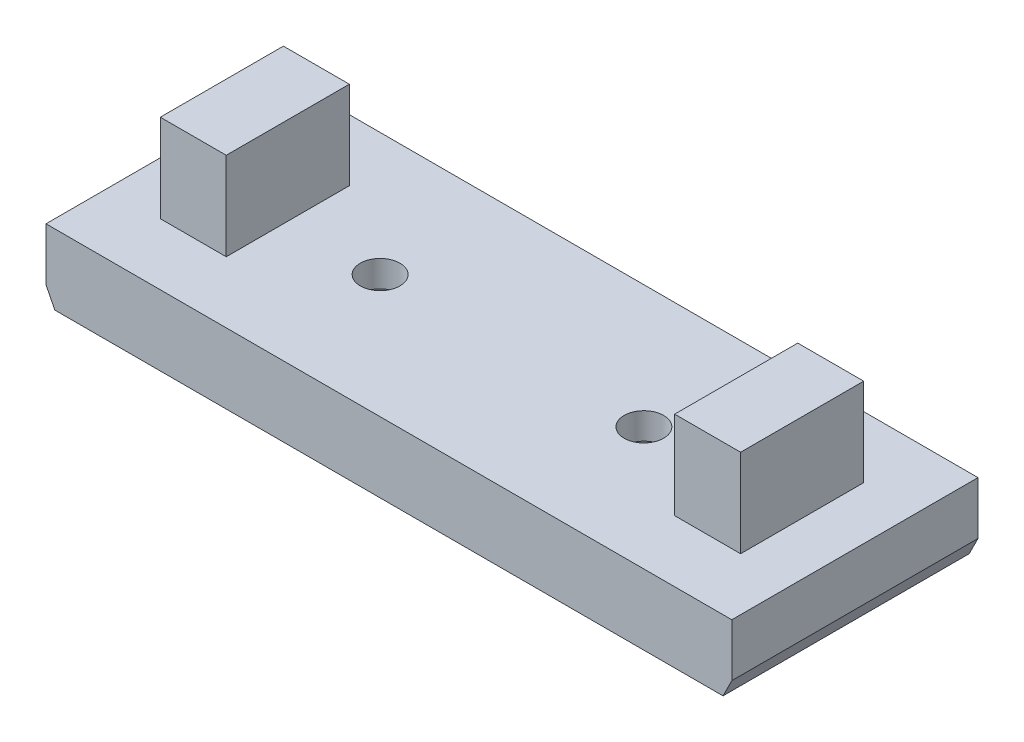
ISO-10303-21;
HEADER;
FILE_DESCRIPTION(('STEP AP214'),'2;1');
FILE_NAME('part.step','',(''),(''),'','','');
FILE_SCHEMA(('AUTOMOTIVE_DESIGN { 1 0 10303 214 1 1 1 1 }'));
ENDSEC;
DATA;
#1=APPLICATION_CONTEXT('core data for automotive mechanical design processes');
#2=APPLICATION_PROTOCOL_DEFINITION('international standard','automotive_design',2000,#1);
#3=PRODUCT_CONTEXT('',#1,'mechanical');
#4=PRODUCT('Part','Part','',(#3));
#5=PRODUCT_RELATED_PRODUCT_CATEGORY('part','',(#4));
#6=PRODUCT_DEFINITION_FORMATION('','',#4);
#7=PRODUCT_DEFINITION_CONTEXT('part definition',#1,'design');
#8=PRODUCT_DEFINITION('design','',#6,#7);
#9=PRODUCT_DEFINITION_SHAPE('','',#8);
#10=(LENGTH_UNIT() NAMED_UNIT(*) SI_UNIT(.MILLI.,.METRE.));
#11=(NAMED_UNIT(*) PLANE_ANGLE_UNIT() SI_UNIT($,.RADIAN.));
#12=(NAMED_UNIT(*) SI_UNIT($,.STERADIAN.) SOLID_ANGLE_UNIT());
#13=UNCERTAINTY_MEASURE_WITH_UNIT(LENGTH_MEASURE(1.E-05),#10,'distance_accuracy_value','');
#14=(GEOMETRIC_REPRESENTATION_CONTEXT(3) GLOBAL_UNCERTAINTY_ASSIGNED_CONTEXT((#13)) GLOBAL_UNIT_ASSIGNED_CONTEXT((#10,
#11,#12)) REPRESENTATION_CONTEXT('',''));
#15=CARTESIAN_POINT('',(0.,0.,0.));
#16=DIRECTION('',(0.,0.,1.));
#17=DIRECTION('',(1.,0.,0.));
#18=AXIS2_PLACEMENT_3D('',#15,#16,#17);
#19=CARTESIAN_POINT('',(0.,4.,0.));
#20=DIRECTION('',(0.,1.,0.));
#21=DIRECTION('',(0.,0.,1.));
#22=AXIS2_PLACEMENT_3D('',#19,#20,#21);
#23=PLANE('',#22);
#24=CARTESIAN_POINT('',(7.50000000000003,4.,0.));
#25=DIRECTION('',(0.,1.,0.));
#26=DIRECTION('',(0.,0.,1.));
#27=AXIS2_PLACEMENT_3D('',#24,#25,#26);
#28=CIRCLE('',#27,1.125);
#29=CARTESIAN_POINT('',(7.50000000000003,4.,1.125));
#30=VERTEX_POINT('',#29);
#31=EDGE_CURVE('E249',#30,#30,#28,.F.);
#32=ORIENTED_EDGE('',*,*,#31,.T.);
#33=EDGE_LOOP('',(#32));
#34=FACE_BOUND('',#33,.T.);
#35=CARTESIAN_POINT('',(-7.5,4.,0.));
#36=DIRECTION('',(0.,1.,0.));
#37=DIRECTION('',(0.,0.,1.));
#38=AXIS2_PLACEMENT_3D('',#35,#36,#37);
#39=CIRCLE('',#38,1.125);
#40=CARTESIAN_POINT('',(-7.5,4.,1.125));
#41=VERTEX_POINT('',#40);
#42=EDGE_CURVE('E238',#41,#41,#39,.F.);
#43=ORIENTED_EDGE('',*,*,#42,.T.);
#44=EDGE_LOOP('',(#43));
#45=FACE_BOUND('',#44,.T.);
#46=DIRECTION('',(0.,0.,1.));
#47=VECTOR('',#46,1.);
#48=CARTESIAN_POINT('',(-19.5,4.,-7.));
#49=LINE('',#48,#47);
#50=CARTESIAN_POINT('',(-19.5,4.,-7.));
#51=VERTEX_POINT('',#50);
#52=CARTESIAN_POINT('',(-19.5,4.,7.));
#53=VERTEX_POINT('',#52);
#54=EDGE_CURVE('E345',#51,#53,#49,.T.);
#55=ORIENTED_EDGE('',*,*,#54,.T.);
#56=DIRECTION('',(1.,0.,0.));
#57=VECTOR('',#56,1.);
#58=CARTESIAN_POINT('',(-19.5,4.,7.));
#59=LINE('',#58,#57);
#60=CARTESIAN_POINT('',(19.5,4.,7.));
#61=VERTEX_POINT('',#60);
#62=EDGE_CURVE('E348',#53,#61,#59,.T.);
#63=ORIENTED_EDGE('',*,*,#62,.T.);
#64=DIRECTION('',(0.,0.,-1.));
#65=VECTOR('',#64,1.);
#66=CARTESIAN_POINT('',(19.5,4.,-7.));
#67=LINE('',#66,#65);
#68=CARTESIAN_POINT('',(19.5,4.,-7.));
#69=VERTEX_POINT('',#68);
#70=EDGE_CURVE('E229',#61,#69,#67,.T.);
#71=ORIENTED_EDGE('',*,*,#70,.T.);
#72=DIRECTION('',(-1.,0.,0.));
#73=VECTOR('',#72,1.);
#74=CARTESIAN_POINT('',(-19.5,4.,-7.));
#75=LINE('',#74,#73);
#76=EDGE_CURVE('E351',#69,#51,#75,.T.);
#77=ORIENTED_EDGE('',*,*,#76,.T.);
#78=EDGE_LOOP('',(#55,#63,#71,#77));
#79=FACE_BOUND('',#78,.T.);
#80=DIRECTION('',(-1.,0.,0.));
#81=VECTOR('',#80,1.);
#82=CARTESIAN_POINT('',(-12.75,4.,-3.5));
#83=LINE('',#82,#81);
#84=CARTESIAN_POINT('',(-12.75,4.,-3.5));
#85=VERTEX_POINT('',#84);
#86=CARTESIAN_POINT('',(-16.5,4.,-3.5));
#87=VERTEX_POINT('',#86);
#88=EDGE_CURVE('E417',#85,#87,#83,.T.);
#89=ORIENTED_EDGE('',*,*,#88,.F.);
#90=DIRECTION('',(0.,0.,-1.));
#91=VECTOR('',#90,1.);
#92=CARTESIAN_POINT('',(-12.75,4.,-3.5));
#93=LINE('',#92,#91);
#94=CARTESIAN_POINT('',(-12.75,4.,3.5));
#95=VERTEX_POINT('',#94);
#96=EDGE_CURVE('E403',#95,#85,#93,.T.);
#97=ORIENTED_EDGE('',*,*,#96,.F.);
#98=DIRECTION('',(1.,0.,0.));
#99=VECTOR('',#98,1.);
#100=CARTESIAN_POINT('',(-12.75,4.,3.5));
#101=LINE('',#100,#99);
#102=CARTESIAN_POINT('',(-16.5,4.,3.5));
#103=VERTEX_POINT('',#102);
#104=EDGE_CURVE('E408',#103,#95,#101,.T.);
#105=ORIENTED_EDGE('',*,*,#104,.F.);
#106=DIRECTION('',(0.,0.,1.));
#107=VECTOR('',#106,1.);
#108=CARTESIAN_POINT('',(-16.5,4.,-3.5));
#109=LINE('',#108,#107);
#110=EDGE_CURVE('E419',#87,#103,#109,.T.);
#111=ORIENTED_EDGE('',*,*,#110,.F.);
#112=EDGE_LOOP('',(#89,#97,#105,#111));
#113=FACE_BOUND('',#112,.T.);
#114=DIRECTION('',(1.,0.,0.));
#115=VECTOR('',#114,1.);
#116=CARTESIAN_POINT('',(12.75,4.,3.5));
#117=LINE('',#116,#115);
#118=CARTESIAN_POINT('',(12.75,4.,3.5));
#119=VERTEX_POINT('',#118);
#120=CARTESIAN_POINT('',(16.5,4.,3.5));
#121=VERTEX_POINT('',#120);
#122=EDGE_CURVE('E369',#119,#121,#117,.T.);
#123=ORIENTED_EDGE('',*,*,#122,.F.);
#124=DIRECTION('',(0.,0.,1.));
#125=VECTOR('',#124,1.);
#126=CARTESIAN_POINT('',(12.75,4.,-3.5));
#127=LINE('',#126,#125);
#128=CARTESIAN_POINT('',(12.75,4.,-3.5));
#129=VERTEX_POINT('',#128);
#130=EDGE_CURVE('E366',#129,#119,#127,.T.);
#131=ORIENTED_EDGE('',*,*,#130,.F.);
#132=DIRECTION('',(-1.,0.,0.));
#133=VECTOR('',#132,1.);
#134=CARTESIAN_POINT('',(12.75,4.,-3.5));
#135=LINE('',#134,#133);
#136=CARTESIAN_POINT('',(16.5,4.,-3.5));
#137=VERTEX_POINT('',#136);
#138=EDGE_CURVE('E382',#137,#129,#135,.T.);
#139=ORIENTED_EDGE('',*,*,#138,.F.);
#140=DIRECTION('',(0.,0.,-1.));
#141=VECTOR('',#140,1.);
#142=CARTESIAN_POINT('',(16.5,4.,-3.5));
#143=LINE('',#142,#141);
#144=EDGE_CURVE('E390',#121,#137,#143,.T.);
#145=ORIENTED_EDGE('',*,*,#144,.F.);
#146=EDGE_LOOP('',(#123,#131,#139,#145));
#147=FACE_BOUND('',#146,.T.);
#148=ADVANCED_FACE('F35',(#34,#45,#79,#113,#147),#23,.T.);
#149=CARTESIAN_POINT('',(-19.5,4.,-7.));
#150=DIRECTION('',(1.,0.,0.));
#151=DIRECTION('',(0.,0.,-1.));
#152=AXIS2_PLACEMENT_3D('',#149,#150,#151);
#153=PLANE('',#152);
#154=DIRECTION('',(0.,-1.,0.));
#155=VECTOR('',#154,1.);
#156=CARTESIAN_POINT('',(-19.5,4.,-7.));
#157=LINE('',#156,#155);
#158=CARTESIAN_POINT('',(-19.5,1.,-7.));
#159=VERTEX_POINT('',#158);
#160=EDGE_CURVE('E232',#51,#159,#157,.T.);
#161=ORIENTED_EDGE('',*,*,#160,.T.);
#162=DIRECTION('',(0.,0.,1.));
#163=VECTOR('',#162,1.);
#164=CARTESIAN_POINT('',(-19.5,1.,-8.1180339887499));
#165=LINE('',#164,#163);
#166=CARTESIAN_POINT('',(-19.5,1.,7.));
#167=VERTEX_POINT('',#166);
#168=EDGE_CURVE('E360',#159,#167,#165,.T.);
#169=ORIENTED_EDGE('',*,*,#168,.T.);
#170=DIRECTION('',(0.,-1.,0.));
#171=VECTOR('',#170,1.);
#172=CARTESIAN_POINT('',(-19.5,4.,7.));
#173=LINE('',#172,#171);
#174=EDGE_CURVE('E12',#53,#167,#173,.T.);
#175=ORIENTED_EDGE('',*,*,#174,.F.);
#176=ORIENTED_EDGE('',*,*,#54,.F.);
#177=EDGE_LOOP('',(#161,#169,#175,#176));
#178=FACE_BOUND('',#177,.T.);
#179=ADVANCED_FACE('F37',(#178),#153,.F.);
#180=CARTESIAN_POINT('',(-19.5,4.,7.));
#181=DIRECTION('',(0.,0.,-1.));
#182=DIRECTION('',(-1.,0.,0.));
#183=AXIS2_PLACEMENT_3D('',#180,#181,#182);
#184=PLANE('',#183);
#185=DIRECTION('',(1.,0.,0.));
#186=VECTOR('',#185,1.);
#187=CARTESIAN_POINT('',(-19.5,0.,7.));
#188=LINE('',#187,#186);
#189=CARTESIAN_POINT('',(-19.,0.,7.));
#190=VERTEX_POINT('',#189);
#191=CARTESIAN_POINT('',(19.,0.,7.));
#192=VERTEX_POINT('',#191);
#193=EDGE_CURVE('E226',#190,#192,#188,.T.);
#194=ORIENTED_EDGE('',*,*,#193,.T.);
#195=DIRECTION('',(-0.447213595499958,-0.894427190999916,0.));
#196=VECTOR('',#195,1.);
#197=CARTESIAN_POINT('',(19.,0.,7.));
#198=LINE('',#197,#196);
#199=CARTESIAN_POINT('',(19.5,1.,7.));
#200=VERTEX_POINT('',#199);
#201=EDGE_CURVE('E52',#200,#192,#198,.T.);
#202=ORIENTED_EDGE('',*,*,#201,.F.);
#203=DIRECTION('',(0.,-1.,0.));
#204=VECTOR('',#203,1.);
#205=CARTESIAN_POINT('',(19.5,4.,7.));
#206=LINE('',#205,#204);
#207=EDGE_CURVE('E44',#61,#200,#206,.T.);
#208=ORIENTED_EDGE('',*,*,#207,.F.);
#209=ORIENTED_EDGE('',*,*,#62,.F.);
#210=ORIENTED_EDGE('',*,*,#174,.T.);
#211=DIRECTION('',(-0.447213595499958,0.894427190999916,0.));
#212=VECTOR('',#211,1.);
#213=CARTESIAN_POINT('',(-19.5,1.,7.));
#214=LINE('',#213,#212);
#215=EDGE_CURVE('E375',#190,#167,#214,.T.);
#216=ORIENTED_EDGE('',*,*,#215,.F.);
#217=EDGE_LOOP('',(#194,#202,#208,#209,#210,#216));
#218=FACE_BOUND('',#217,.T.);
#219=ADVANCED_FACE('F222',(#218),#184,.F.);
#220=CARTESIAN_POINT('',(19.5,4.,-7.));
#221=DIRECTION('',(-1.,0.,0.));
#222=DIRECTION('',(0.,0.,1.));
#223=AXIS2_PLACEMENT_3D('',#220,#221,#222);
#224=PLANE('',#223);
#225=ORIENTED_EDGE('',*,*,#207,.T.);
#226=DIRECTION('',(0.,0.,1.));
#227=VECTOR('',#226,1.);
#228=CARTESIAN_POINT('',(19.5,1.,-8.1180339887499));
#229=LINE('',#228,#227);
#230=CARTESIAN_POINT('',(19.5,1.,-7.));
#231=VERTEX_POINT('',#230);
#232=EDGE_CURVE('E210',#231,#200,#229,.T.);
#233=ORIENTED_EDGE('',*,*,#232,.F.);
#234=DIRECTION('',(0.,-1.,0.));
#235=VECTOR('',#234,1.);
#236=CARTESIAN_POINT('',(19.5,4.,-7.));
#237=LINE('',#236,#235);
#238=EDGE_CURVE('E230',#69,#231,#237,.T.);
#239=ORIENTED_EDGE('',*,*,#238,.F.);
#240=ORIENTED_EDGE('',*,*,#70,.F.);
#241=EDGE_LOOP('',(#225,#233,#239,#240));
#242=FACE_BOUND('',#241,.T.);
#243=ADVANCED_FACE('F228',(#242),#224,.F.);
#244=CARTESIAN_POINT('',(-19.5,4.,-7.));
#245=DIRECTION('',(0.,0.,1.));
#246=DIRECTION('',(1.,0.,0.));
#247=AXIS2_PLACEMENT_3D('',#244,#245,#246);
#248=PLANE('',#247);
#249=ORIENTED_EDGE('',*,*,#238,.T.);
#250=DIRECTION('',(0.447213595499958,0.894427190999916,0.));
#251=VECTOR('',#250,1.);
#252=CARTESIAN_POINT('',(19.,0.,-7.));
#253=LINE('',#252,#251);
#254=CARTESIAN_POINT('',(19.,0.,-7.));
#255=VERTEX_POINT('',#254);
#256=EDGE_CURVE('E212',#255,#231,#253,.T.);
#257=ORIENTED_EDGE('',*,*,#256,.F.);
#258=DIRECTION('',(-1.,0.,0.));
#259=VECTOR('',#258,1.);
#260=CARTESIAN_POINT('',(-19.5,0.,-7.));
#261=LINE('',#260,#259);
#262=CARTESIAN_POINT('',(-19.,0.,-7.));
#263=VERTEX_POINT('',#262);
#264=EDGE_CURVE('E60',#255,#263,#261,.T.);
#265=ORIENTED_EDGE('',*,*,#264,.T.);
#266=DIRECTION('',(0.447213595499958,-0.894427190999916,0.));
#267=VECTOR('',#266,1.);
#268=CARTESIAN_POINT('',(-19.5,1.,-7.));
#269=LINE('',#268,#267);
#270=EDGE_CURVE('E363',#159,#263,#269,.T.);
#271=ORIENTED_EDGE('',*,*,#270,.F.);
#272=ORIENTED_EDGE('',*,*,#160,.F.);
#273=ORIENTED_EDGE('',*,*,#76,.F.);
#274=EDGE_LOOP('',(#249,#257,#265,#271,#272,#273));
#275=FACE_BOUND('',#274,.T.);
#276=ADVANCED_FACE('F362',(#275),#248,.F.);
#277=CARTESIAN_POINT('',(0.,0.,0.));
#278=DIRECTION('',(0.,1.,0.));
#279=DIRECTION('',(0.,0.,1.));
#280=AXIS2_PLACEMENT_3D('',#277,#278,#279);
#281=PLANE('',#280);
#282=DIRECTION('',(-1.,0.,0.));
#283=VECTOR('',#282,1.);
#284=CARTESIAN_POINT('',(-6.24426316451256,0.,2.175));
#285=LINE('',#284,#283);
#286=CARTESIAN_POINT('',(-6.24426316451256,0.,2.175));
#287=VERTEX_POINT('',#286);
#288=CARTESIAN_POINT('',(-8.75573683548744,0.,2.175));
#289=VERTEX_POINT('',#288);
#290=EDGE_CURVE('E262',#287,#289,#285,.T.);
#291=ORIENTED_EDGE('',*,*,#290,.F.);
#292=DIRECTION('',(-0.5,0.,0.866025403784439));
#293=VECTOR('',#292,1.);
#294=CARTESIAN_POINT('',(-4.98852632902513,0.,0.));
#295=LINE('',#294,#293);
#296=CARTESIAN_POINT('',(-4.98852632902513,0.,0.));
#297=VERTEX_POINT('',#296);
#298=EDGE_CURVE('E242',#297,#287,#295,.T.);
#299=ORIENTED_EDGE('',*,*,#298,.F.);
#300=DIRECTION('',(0.5,0.,0.866025403784439));
#301=VECTOR('',#300,1.);
#302=CARTESIAN_POINT('',(-6.24426316451256,0.,-2.175));
#303=LINE('',#302,#301);
#304=CARTESIAN_POINT('',(-6.24426316451256,0.,-2.175));
#305=VERTEX_POINT('',#304);
#306=EDGE_CURVE('E237',#305,#297,#303,.T.);
#307=ORIENTED_EDGE('',*,*,#306,.F.);
#308=DIRECTION('',(1.,0.,0.));
#309=VECTOR('',#308,1.);
#310=CARTESIAN_POINT('',(-8.75573683548743,0.,-2.175));
#311=LINE('',#310,#309);
#312=CARTESIAN_POINT('',(-8.75573683548743,0.,-2.175));
#313=VERTEX_POINT('',#312);
#314=EDGE_CURVE('E253',#313,#305,#311,.T.);
#315=ORIENTED_EDGE('',*,*,#314,.F.);
#316=DIRECTION('',(0.5,0.,-0.866025403784439));
#317=VECTOR('',#316,1.);
#318=CARTESIAN_POINT('',(-10.0114736709749,0.,0.));
#319=LINE('',#318,#317);
#320=CARTESIAN_POINT('',(-10.0114736709749,0.,0.));
#321=VERTEX_POINT('',#320);
#322=EDGE_CURVE('E256',#321,#313,#319,.T.);
#323=ORIENTED_EDGE('',*,*,#322,.F.);
#324=DIRECTION('',(-0.5,0.,-0.866025403784439));
#325=VECTOR('',#324,1.);
#326=CARTESIAN_POINT('',(-8.75573683548744,0.,2.175));
#327=LINE('',#326,#325);
#328=EDGE_CURVE('E259',#289,#321,#327,.T.);
#329=ORIENTED_EDGE('',*,*,#328,.F.);
#330=EDGE_LOOP('',(#291,#299,#307,#315,#323,#329));
#331=FACE_BOUND('',#330,.T.);
#332=DIRECTION('',(-1.,0.,0.));
#333=VECTOR('',#332,1.);
#334=CARTESIAN_POINT('',(8.75573683548741,0.,2.17500000000001));
#335=LINE('',#334,#333);
#336=CARTESIAN_POINT('',(8.75573683548741,0.,2.17500000000001));
#337=VERTEX_POINT('',#336);
#338=CARTESIAN_POINT('',(6.24426316451259,0.,2.17500000000001));
#339=VERTEX_POINT('',#338);
#340=EDGE_CURVE('E307',#337,#339,#335,.T.);
#341=ORIENTED_EDGE('',*,*,#340,.F.);
#342=DIRECTION('',(-0.5,0.,0.866025403784438));
#343=VECTOR('',#342,1.);
#344=CARTESIAN_POINT('',(10.0114736709749,0.,0.));
#345=LINE('',#344,#343);
#346=CARTESIAN_POINT('',(10.0114736709749,0.,0.));
#347=VERTEX_POINT('',#346);
#348=EDGE_CURVE('E310',#347,#337,#345,.T.);
#349=ORIENTED_EDGE('',*,*,#348,.F.);
#350=DIRECTION('',(0.5,0.,0.866025403784439));
#351=VECTOR('',#350,1.);
#352=CARTESIAN_POINT('',(8.75573683548743,0.,-2.17499999999998));
#353=LINE('',#352,#351);
#354=CARTESIAN_POINT('',(8.75573683548743,0.,-2.17499999999998));
#355=VERTEX_POINT('',#354);
#356=EDGE_CURVE('E297',#355,#347,#353,.T.);
#357=ORIENTED_EDGE('',*,*,#356,.F.);
#358=DIRECTION('',(1.,0.,0.));
#359=VECTOR('',#358,1.);
#360=CARTESIAN_POINT('',(6.24426316451257,0.,-2.17499999999998));
#361=LINE('',#360,#359);
#362=CARTESIAN_POINT('',(6.24426316451257,0.,-2.17499999999998));
#363=VERTEX_POINT('',#362);
#364=EDGE_CURVE('E298',#363,#355,#361,.T.);
#365=ORIENTED_EDGE('',*,*,#364,.F.);
#366=DIRECTION('',(0.500000000000001,0.,-0.866025403784438));
#367=VECTOR('',#366,1.);
#368=CARTESIAN_POINT('',(4.98852632902515,0.,0.));
#369=LINE('',#368,#367);
#370=CARTESIAN_POINT('',(4.98852632902515,0.,0.));
#371=VERTEX_POINT('',#370);
#372=EDGE_CURVE('E301',#371,#363,#369,.T.);
#373=ORIENTED_EDGE('',*,*,#372,.F.);
#374=DIRECTION('',(-0.499999999999999,0.,-0.866025403784439));
#375=VECTOR('',#374,1.);
#376=CARTESIAN_POINT('',(6.24426316451259,0.,2.17500000000001));
#377=LINE('',#376,#375);
#378=EDGE_CURVE('E304',#339,#371,#377,.T.);
#379=ORIENTED_EDGE('',*,*,#378,.F.);
#380=EDGE_LOOP('',(#341,#349,#357,#365,#373,#379));
#381=FACE_BOUND('',#380,.T.);
#382=ORIENTED_EDGE('',*,*,#264,.F.);
#383=DIRECTION('',(0.,0.,1.));
#384=VECTOR('',#383,1.);
#385=CARTESIAN_POINT('',(19.,0.,-8.1180339887499));
#386=LINE('',#385,#384);
#387=EDGE_CURVE('E217',#255,#192,#386,.T.);
#388=ORIENTED_EDGE('',*,*,#387,.T.);
#389=ORIENTED_EDGE('',*,*,#193,.F.);
#390=DIRECTION('',(0.,0.,1.));
#391=VECTOR('',#390,1.);
#392=CARTESIAN_POINT('',(-19.,0.,-8.1180339887499));
#393=LINE('',#392,#391);
#394=EDGE_CURVE('E371',#263,#190,#393,.T.);
#395=ORIENTED_EDGE('',*,*,#394,.F.);
#396=EDGE_LOOP('',(#382,#388,#389,#395));
#397=FACE_BOUND('',#396,.T.);
#398=ADVANCED_FACE('F448',(#331,#381,#397),#281,.F.);
#399=CARTESIAN_POINT('',(0.,2.5,0.));
#400=DIRECTION('',(0.,1.,0.));
#401=DIRECTION('',(0.,0.,1.));
#402=AXIS2_PLACEMENT_3D('',#399,#400,#401);
#403=PLANE('',#402);
#404=CARTESIAN_POINT('',(7.50000000000003,2.5,0.));
#405=DIRECTION('',(0.,1.,0.));
#406=DIRECTION('',(0.,0.,1.));
#407=AXIS2_PLACEMENT_3D('',#404,#405,#406);
#408=CIRCLE('',#407,1.125);
#409=CARTESIAN_POINT('',(7.50000000000003,2.5,1.125));
#410=VERTEX_POINT('',#409);
#411=EDGE_CURVE('E39',#410,#410,#408,.T.);
#412=ORIENTED_EDGE('',*,*,#411,.T.);
#413=EDGE_LOOP('',(#412));
#414=FACE_BOUND('',#413,.T.);
#415=DIRECTION('',(0.5,0.,0.866025403784439));
#416=VECTOR('',#415,1.);
#417=CARTESIAN_POINT('',(8.75573683548743,2.5,-2.17499999999998));
#418=LINE('',#417,#416);
#419=CARTESIAN_POINT('',(8.75573683548743,2.5,-2.17499999999998));
#420=VERTEX_POINT('',#419);
#421=CARTESIAN_POINT('',(10.0114736709749,2.5,0.));
#422=VERTEX_POINT('',#421);
#423=EDGE_CURVE('E318',#420,#422,#418,.T.);
#424=ORIENTED_EDGE('',*,*,#423,.T.);
#425=DIRECTION('',(-0.5,0.,0.866025403784438));
#426=VECTOR('',#425,1.);
#427=CARTESIAN_POINT('',(10.0114736709749,2.5,0.));
#428=LINE('',#427,#426);
#429=CARTESIAN_POINT('',(8.75573683548741,2.5,2.17500000000001));
#430=VERTEX_POINT('',#429);
#431=EDGE_CURVE('E300',#422,#430,#428,.T.);
#432=ORIENTED_EDGE('',*,*,#431,.T.);
#433=DIRECTION('',(-1.,0.,0.));
#434=VECTOR('',#433,1.);
#435=CARTESIAN_POINT('',(8.75573683548741,2.5,2.17500000000001));
#436=LINE('',#435,#434);
#437=CARTESIAN_POINT('',(6.24426316451259,2.5,2.17500000000001));
#438=VERTEX_POINT('',#437);
#439=EDGE_CURVE('E335',#430,#438,#436,.T.);
#440=ORIENTED_EDGE('',*,*,#439,.T.);
#441=DIRECTION('',(-0.499999999999999,0.,-0.866025403784439));
#442=VECTOR('',#441,1.);
#443=CARTESIAN_POINT('',(6.24426316451259,2.5,2.17500000000001));
#444=LINE('',#443,#442);
#445=CARTESIAN_POINT('',(4.98852632902515,2.5,0.));
#446=VERTEX_POINT('',#445);
#447=EDGE_CURVE('E331',#438,#446,#444,.T.);
#448=ORIENTED_EDGE('',*,*,#447,.T.);
#449=DIRECTION('',(0.500000000000001,0.,-0.866025403784438));
#450=VECTOR('',#449,1.);
#451=CARTESIAN_POINT('',(4.98852632902515,2.5,0.));
#452=LINE('',#451,#450);
#453=CARTESIAN_POINT('',(6.24426316451257,2.5,-2.17499999999998));
#454=VERTEX_POINT('',#453);
#455=EDGE_CURVE('E327',#446,#454,#452,.T.);
#456=ORIENTED_EDGE('',*,*,#455,.T.);
#457=DIRECTION('',(1.,0.,0.));
#458=VECTOR('',#457,1.);
#459=CARTESIAN_POINT('',(6.24426316451257,2.5,-2.17499999999998));
#460=LINE('',#459,#458);
#461=EDGE_CURVE('E323',#454,#420,#460,.T.);
#462=ORIENTED_EDGE('',*,*,#461,.T.);
#463=EDGE_LOOP('',(#424,#432,#440,#448,#456,#462));
#464=FACE_BOUND('',#463,.T.);
#465=ADVANCED_FACE('F444',(#414,#464),#403,.F.);
#466=CARTESIAN_POINT('',(10.0114736709749,10.644734757686,0.));
#467=DIRECTION('',(0.866025403784438,0.,0.5));
#468=DIRECTION('',(0.5,0.,-0.866025403784438));
#469=AXIS2_PLACEMENT_3D('',#466,#467,#468);
#470=PLANE('',#469);
#471=DIRECTION('',(0.,-1.,0.));
#472=VECTOR('',#471,1.);
#473=CARTESIAN_POINT('',(10.0114736709749,10.644734757686,0.));
#474=LINE('',#473,#472);
#475=EDGE_CURVE('E321',#422,#347,#474,.T.);
#476=ORIENTED_EDGE('',*,*,#475,.T.);
#477=ORIENTED_EDGE('',*,*,#348,.T.);
#478=DIRECTION('',(0.,-1.,0.));
#479=VECTOR('',#478,1.);
#480=CARTESIAN_POINT('',(8.75573683548741,10.644734757686,2.17500000000001));
#481=LINE('',#480,#479);
#482=EDGE_CURVE('E317',#430,#337,#481,.T.);
#483=ORIENTED_EDGE('',*,*,#482,.F.);
#484=ORIENTED_EDGE('',*,*,#431,.F.);
#485=EDGE_LOOP('',(#476,#477,#483,#484));
#486=FACE_BOUND('',#485,.T.);
#487=ADVANCED_FACE('F447',(#486),#470,.F.);
#488=CARTESIAN_POINT('',(8.75573683548741,10.644734757686,2.17500000000001));
#489=DIRECTION('',(0.,0.,1.));
#490=DIRECTION('',(1.,0.,0.));
#491=AXIS2_PLACEMENT_3D('',#488,#489,#490);
#492=PLANE('',#491);
#493=ORIENTED_EDGE('',*,*,#482,.T.);
#494=ORIENTED_EDGE('',*,*,#340,.T.);
#495=DIRECTION('',(0.,-1.,0.));
#496=VECTOR('',#495,1.);
#497=CARTESIAN_POINT('',(6.24426316451259,10.644734757686,2.17500000000001));
#498=LINE('',#497,#496);
#499=EDGE_CURVE('E334',#438,#339,#498,.T.);
#500=ORIENTED_EDGE('',*,*,#499,.F.);
#501=ORIENTED_EDGE('',*,*,#439,.F.);
#502=EDGE_LOOP('',(#493,#494,#500,#501));
#503=FACE_BOUND('',#502,.T.);
#504=ADVANCED_FACE('F460',(#503),#492,.F.);
#505=CARTESIAN_POINT('',(6.24426316451259,10.644734757686,2.17500000000001));
#506=DIRECTION('',(-0.866025403784439,0.,0.499999999999999));
#507=DIRECTION('',(0.499999999999999,0.,0.866025403784439));
#508=AXIS2_PLACEMENT_3D('',#505,#506,#507);
#509=PLANE('',#508);
#510=ORIENTED_EDGE('',*,*,#499,.T.);
#511=ORIENTED_EDGE('',*,*,#378,.T.);
#512=DIRECTION('',(0.,-1.,0.));
#513=VECTOR('',#512,1.);
#514=CARTESIAN_POINT('',(4.98852632902515,10.644734757686,0.));
#515=LINE('',#514,#513);
#516=EDGE_CURVE('E330',#446,#371,#515,.T.);
#517=ORIENTED_EDGE('',*,*,#516,.F.);
#518=ORIENTED_EDGE('',*,*,#447,.F.);
#519=EDGE_LOOP('',(#510,#511,#517,#518));
#520=FACE_BOUND('',#519,.T.);
#521=ADVANCED_FACE('F465',(#520),#509,.F.);
#522=CARTESIAN_POINT('',(4.98852632902515,10.644734757686,0.));
#523=DIRECTION('',(-0.866025403784438,0.,-0.500000000000001));
#524=DIRECTION('',(-0.500000000000001,0.,0.866025403784438));
#525=AXIS2_PLACEMENT_3D('',#522,#523,#524);
#526=PLANE('',#525);
#527=ORIENTED_EDGE('',*,*,#516,.T.);
#528=ORIENTED_EDGE('',*,*,#372,.T.);
#529=DIRECTION('',(0.,-1.,0.));
#530=VECTOR('',#529,1.);
#531=CARTESIAN_POINT('',(6.24426316451257,10.644734757686,-2.17499999999998));
#532=LINE('',#531,#530);
#533=EDGE_CURVE('E326',#454,#363,#532,.T.);
#534=ORIENTED_EDGE('',*,*,#533,.F.);
#535=ORIENTED_EDGE('',*,*,#455,.F.);
#536=EDGE_LOOP('',(#527,#528,#534,#535));
#537=FACE_BOUND('',#536,.T.);
#538=ADVANCED_FACE('F468',(#537),#526,.F.);
#539=CARTESIAN_POINT('',(6.24426316451257,10.644734757686,-2.17499999999998));
#540=DIRECTION('',(0.,0.,-1.));
#541=DIRECTION('',(-1.,0.,0.));
#542=AXIS2_PLACEMENT_3D('',#539,#540,#541);
#543=PLANE('',#542);
#544=ORIENTED_EDGE('',*,*,#533,.T.);
#545=ORIENTED_EDGE('',*,*,#364,.T.);
#546=DIRECTION('',(0.,-1.,0.));
#547=VECTOR('',#546,1.);
#548=CARTESIAN_POINT('',(8.75573683548743,10.644734757686,-2.17499999999998));
#549=LINE('',#548,#547);
#550=EDGE_CURVE('E322',#420,#355,#549,.T.);
#551=ORIENTED_EDGE('',*,*,#550,.F.);
#552=ORIENTED_EDGE('',*,*,#461,.F.);
#553=EDGE_LOOP('',(#544,#545,#551,#552));
#554=FACE_BOUND('',#553,.T.);
#555=ADVANCED_FACE('F472',(#554),#543,.F.);
#556=CARTESIAN_POINT('',(8.75573683548743,10.644734757686,-2.17499999999998));
#557=DIRECTION('',(0.866025403784439,0.,-0.5));
#558=DIRECTION('',(-0.5,0.,-0.866025403784439));
#559=AXIS2_PLACEMENT_3D('',#556,#557,#558);
#560=PLANE('',#559);
#561=ORIENTED_EDGE('',*,*,#550,.T.);
#562=ORIENTED_EDGE('',*,*,#356,.T.);
#563=ORIENTED_EDGE('',*,*,#475,.F.);
#564=ORIENTED_EDGE('',*,*,#423,.F.);
#565=EDGE_LOOP('',(#561,#562,#563,#564));
#566=FACE_BOUND('',#565,.T.);
#567=ADVANCED_FACE('F453',(#566),#560,.F.);
#568=CARTESIAN_POINT('',(0.,2.5,0.));
#569=DIRECTION('',(0.,1.,0.));
#570=DIRECTION('',(0.,0.,1.));
#571=AXIS2_PLACEMENT_3D('',#568,#569,#570);
#572=PLANE('',#571);
#573=CARTESIAN_POINT('',(-7.5,2.5,0.));
#574=DIRECTION('',(0.,1.,0.));
#575=DIRECTION('',(0.,0.,1.));
#576=AXIS2_PLACEMENT_3D('',#573,#574,#575);
#577=CIRCLE('',#576,1.125);
#578=CARTESIAN_POINT('',(-7.5,2.5,1.125));
#579=VERTEX_POINT('',#578);
#580=EDGE_CURVE('E235',#579,#579,#577,.T.);
#581=ORIENTED_EDGE('',*,*,#580,.T.);
#582=EDGE_LOOP('',(#581));
#583=FACE_BOUND('',#582,.T.);
#584=DIRECTION('',(0.5,0.,0.866025403784439));
#585=VECTOR('',#584,1.);
#586=CARTESIAN_POINT('',(-6.24426316451256,2.5,-2.175));
#587=LINE('',#586,#585);
#588=CARTESIAN_POINT('',(-6.24426316451256,2.5,-2.175));
#589=VERTEX_POINT('',#588);
#590=CARTESIAN_POINT('',(-4.98852632902513,2.5,0.));
#591=VERTEX_POINT('',#590);
#592=EDGE_CURVE('E270',#589,#591,#587,.T.);
#593=ORIENTED_EDGE('',*,*,#592,.T.);
#594=DIRECTION('',(-0.5,0.,0.866025403784439));
#595=VECTOR('',#594,1.);
#596=CARTESIAN_POINT('',(-4.98852632902513,2.5,0.));
#597=LINE('',#596,#595);
#598=CARTESIAN_POINT('',(-6.24426316451256,2.5,2.175));
#599=VERTEX_POINT('',#598);
#600=EDGE_CURVE('E255',#591,#599,#597,.T.);
#601=ORIENTED_EDGE('',*,*,#600,.T.);
#602=DIRECTION('',(-1.,0.,0.));
#603=VECTOR('',#602,1.);
#604=CARTESIAN_POINT('',(-6.24426316451256,2.5,2.175));
#605=LINE('',#604,#603);
#606=CARTESIAN_POINT('',(-8.75573683548744,2.5,2.175));
#607=VERTEX_POINT('',#606);
#608=EDGE_CURVE('E287',#599,#607,#605,.T.);
#609=ORIENTED_EDGE('',*,*,#608,.T.);
#610=DIRECTION('',(-0.5,0.,-0.866025403784439));
#611=VECTOR('',#610,1.);
#612=CARTESIAN_POINT('',(-8.75573683548744,2.5,2.175));
#613=LINE('',#612,#611);
#614=CARTESIAN_POINT('',(-10.0114736709749,2.5,0.));
#615=VERTEX_POINT('',#614);
#616=EDGE_CURVE('E283',#607,#615,#613,.T.);
#617=ORIENTED_EDGE('',*,*,#616,.T.);
#618=DIRECTION('',(0.5,0.,-0.866025403784439));
#619=VECTOR('',#618,1.);
#620=CARTESIAN_POINT('',(-10.0114736709749,2.5,0.));
#621=LINE('',#620,#619);
#622=CARTESIAN_POINT('',(-8.75573683548743,2.5,-2.175));
#623=VERTEX_POINT('',#622);
#624=EDGE_CURVE('E279',#615,#623,#621,.T.);
#625=ORIENTED_EDGE('',*,*,#624,.T.);
#626=DIRECTION('',(1.,0.,0.));
#627=VECTOR('',#626,1.);
#628=CARTESIAN_POINT('',(-8.75573683548743,2.5,-2.175));
#629=LINE('',#628,#627);
#630=EDGE_CURVE('E275',#623,#589,#629,.T.);
#631=ORIENTED_EDGE('',*,*,#630,.T.);
#632=EDGE_LOOP('',(#593,#601,#609,#617,#625,#631));
#633=FACE_BOUND('',#632,.T.);
#634=ADVANCED_FACE('F567',(#583,#633),#572,.F.);
#635=CARTESIAN_POINT('',(-4.98852632902513,10.644734757686,0.));
#636=DIRECTION('',(0.866025403784439,0.,0.5));
#637=DIRECTION('',(0.5,0.,-0.866025403784439));
#638=AXIS2_PLACEMENT_3D('',#635,#636,#637);
#639=PLANE('',#638);
#640=DIRECTION('',(0.,-1.,0.));
#641=VECTOR('',#640,1.);
#642=CARTESIAN_POINT('',(-4.98852632902513,10.644734757686,0.));
#643=LINE('',#642,#641);
#644=EDGE_CURVE('E273',#591,#297,#643,.T.);
#645=ORIENTED_EDGE('',*,*,#644,.T.);
#646=ORIENTED_EDGE('',*,*,#298,.T.);
#647=DIRECTION('',(0.,-1.,0.));
#648=VECTOR('',#647,1.);
#649=CARTESIAN_POINT('',(-6.24426316451256,10.644734757686,2.175));
#650=LINE('',#649,#648);
#651=EDGE_CURVE('E269',#599,#287,#650,.T.);
#652=ORIENTED_EDGE('',*,*,#651,.F.);
#653=ORIENTED_EDGE('',*,*,#600,.F.);
#654=EDGE_LOOP('',(#645,#646,#652,#653));
#655=FACE_BOUND('',#654,.T.);
#656=ADVANCED_FACE('F563',(#655),#639,.F.);
#657=CARTESIAN_POINT('',(-6.24426316451256,10.644734757686,2.175));
#658=DIRECTION('',(0.,0.,1.));
#659=DIRECTION('',(1.,0.,0.));
#660=AXIS2_PLACEMENT_3D('',#657,#658,#659);
#661=PLANE('',#660);
#662=ORIENTED_EDGE('',*,*,#651,.T.);
#663=ORIENTED_EDGE('',*,*,#290,.T.);
#664=DIRECTION('',(0.,-1.,0.));
#665=VECTOR('',#664,1.);
#666=CARTESIAN_POINT('',(-8.75573683548744,10.644734757686,2.175));
#667=LINE('',#666,#665);
#668=EDGE_CURVE('E286',#607,#289,#667,.T.);
#669=ORIENTED_EDGE('',*,*,#668,.F.);
#670=ORIENTED_EDGE('',*,*,#608,.F.);
#671=EDGE_LOOP('',(#662,#663,#669,#670));
#672=FACE_BOUND('',#671,.T.);
#673=ADVANCED_FACE('F559',(#672),#661,.F.);
#674=CARTESIAN_POINT('',(-8.75573683548744,10.644734757686,2.175));
#675=DIRECTION('',(-0.866025403784439,0.,0.5));
#676=DIRECTION('',(0.5,0.,0.866025403784439));
#677=AXIS2_PLACEMENT_3D('',#674,#675,#676);
#678=PLANE('',#677);
#679=ORIENTED_EDGE('',*,*,#668,.T.);
#680=ORIENTED_EDGE('',*,*,#328,.T.);
#681=DIRECTION('',(0.,-1.,0.));
#682=VECTOR('',#681,1.);
#683=CARTESIAN_POINT('',(-10.0114736709749,10.644734757686,0.));
#684=LINE('',#683,#682);
#685=EDGE_CURVE('E282',#615,#321,#684,.T.);
#686=ORIENTED_EDGE('',*,*,#685,.F.);
#687=ORIENTED_EDGE('',*,*,#616,.F.);
#688=EDGE_LOOP('',(#679,#680,#686,#687));
#689=FACE_BOUND('',#688,.T.);
#690=ADVANCED_FACE('F555',(#689),#678,.F.);
#691=CARTESIAN_POINT('',(-10.0114736709749,10.644734757686,0.));
#692=DIRECTION('',(-0.866025403784439,0.,-0.5));
#693=DIRECTION('',(-0.5,0.,0.866025403784439));
#694=AXIS2_PLACEMENT_3D('',#691,#692,#693);
#695=PLANE('',#694);
#696=ORIENTED_EDGE('',*,*,#685,.T.);
#697=ORIENTED_EDGE('',*,*,#322,.T.);
#698=DIRECTION('',(0.,-1.,0.));
#699=VECTOR('',#698,1.);
#700=CARTESIAN_POINT('',(-8.75573683548743,10.644734757686,-2.175));
#701=LINE('',#700,#699);
#702=EDGE_CURVE('E278',#623,#313,#701,.T.);
#703=ORIENTED_EDGE('',*,*,#702,.F.);
#704=ORIENTED_EDGE('',*,*,#624,.F.);
#705=EDGE_LOOP('',(#696,#697,#703,#704));
#706=FACE_BOUND('',#705,.T.);
#707=ADVANCED_FACE('F551',(#706),#695,.F.);
#708=CARTESIAN_POINT('',(-8.75573683548743,10.644734757686,-2.175));
#709=DIRECTION('',(0.,0.,-1.));
#710=DIRECTION('',(-1.,0.,0.));
#711=AXIS2_PLACEMENT_3D('',#708,#709,#710);
#712=PLANE('',#711);
#713=ORIENTED_EDGE('',*,*,#702,.T.);
#714=ORIENTED_EDGE('',*,*,#314,.T.);
#715=DIRECTION('',(0.,-1.,0.));
#716=VECTOR('',#715,1.);
#717=CARTESIAN_POINT('',(-6.24426316451256,10.644734757686,-2.175));
#718=LINE('',#717,#716);
#719=EDGE_CURVE('E274',#589,#305,#718,.T.);
#720=ORIENTED_EDGE('',*,*,#719,.F.);
#721=ORIENTED_EDGE('',*,*,#630,.F.);
#722=EDGE_LOOP('',(#713,#714,#720,#721));
#723=FACE_BOUND('',#722,.T.);
#724=ADVANCED_FACE('F547',(#723),#712,.F.);
#725=CARTESIAN_POINT('',(-6.24426316451256,10.644734757686,-2.175));
#726=DIRECTION('',(0.866025403784439,0.,-0.5));
#727=DIRECTION('',(-0.5,0.,-0.866025403784439));
#728=AXIS2_PLACEMENT_3D('',#725,#726,#727);
#729=PLANE('',#728);
#730=ORIENTED_EDGE('',*,*,#719,.T.);
#731=ORIENTED_EDGE('',*,*,#306,.T.);
#732=ORIENTED_EDGE('',*,*,#644,.F.);
#733=ORIENTED_EDGE('',*,*,#592,.F.);
#734=EDGE_LOOP('',(#730,#731,#732,#733));
#735=FACE_BOUND('',#734,.T.);
#736=ADVANCED_FACE('F543',(#735),#729,.F.);
#737=CARTESIAN_POINT('',(-7.5,7.18198051533946,0.));
#738=DIRECTION('',(0.,-1.,0.));
#739=DIRECTION('',(0.,0.,-1.));
#740=AXIS2_PLACEMENT_3D('',#737,#738,#739);
#741=CYLINDRICAL_SURFACE('',#740,1.125);
#742=ORIENTED_EDGE('',*,*,#42,.F.);
#743=EDGE_LOOP('',(#742));
#744=FACE_BOUND('',#743,.T.);
#745=ORIENTED_EDGE('',*,*,#580,.F.);
#746=EDGE_LOOP('',(#745));
#747=FACE_BOUND('',#746,.T.);
#748=ADVANCED_FACE('F440',(#744,#747),#741,.F.);
#749=CARTESIAN_POINT('',(7.50000000000003,7.18198051533946,0.));
#750=DIRECTION('',(0.,-1.,0.));
#751=DIRECTION('',(0.,0.,-1.));
#752=AXIS2_PLACEMENT_3D('',#749,#750,#751);
#753=CYLINDRICAL_SURFACE('',#752,1.125);
#754=ORIENTED_EDGE('',*,*,#31,.F.);
#755=EDGE_LOOP('',(#754));
#756=FACE_BOUND('',#755,.T.);
#757=ORIENTED_EDGE('',*,*,#411,.F.);
#758=EDGE_LOOP('',(#757));
#759=FACE_BOUND('',#758,.T.);
#760=ADVANCED_FACE('F436',(#756,#759),#753,.F.);
#761=CARTESIAN_POINT('',(-12.75,9.,-3.5));
#762=DIRECTION('',(-1.,0.,0.));
#763=DIRECTION('',(0.,0.,1.));
#764=AXIS2_PLACEMENT_3D('',#761,#762,#763);
#765=PLANE('',#764);
#766=ORIENTED_EDGE('',*,*,#96,.T.);
#767=DIRECTION('',(0.,-1.,0.));
#768=VECTOR('',#767,1.);
#769=CARTESIAN_POINT('',(-12.75,9.,-3.5));
#770=LINE('',#769,#768);
#771=CARTESIAN_POINT('',(-12.75,9.,-3.5));
#772=VERTEX_POINT('',#771);
#773=EDGE_CURVE('E429',#772,#85,#770,.T.);
#774=ORIENTED_EDGE('',*,*,#773,.F.);
#775=DIRECTION('',(0.,0.,-1.));
#776=VECTOR('',#775,1.);
#777=CARTESIAN_POINT('',(-12.75,9.,-3.5));
#778=LINE('',#777,#776);
#779=CARTESIAN_POINT('',(-12.75,9.,3.5));
#780=VERTEX_POINT('',#779);
#781=EDGE_CURVE('E404',#780,#772,#778,.T.);
#782=ORIENTED_EDGE('',*,*,#781,.F.);
#783=DIRECTION('',(0.,-1.,0.));
#784=VECTOR('',#783,1.);
#785=CARTESIAN_POINT('',(-12.75,9.,3.5));
#786=LINE('',#785,#784);
#787=EDGE_CURVE('E414',#780,#95,#786,.T.);
#788=ORIENTED_EDGE('',*,*,#787,.T.);
#789=EDGE_LOOP('',(#766,#774,#782,#788));
#790=FACE_BOUND('',#789,.T.);
#791=ADVANCED_FACE('F439',(#790),#765,.F.);
#792=CARTESIAN_POINT('',(-12.75,9.,-3.5));
#793=DIRECTION('',(0.,0.,1.));
#794=DIRECTION('',(1.,0.,0.));
#795=AXIS2_PLACEMENT_3D('',#792,#793,#794);
#796=PLANE('',#795);
#797=ORIENTED_EDGE('',*,*,#88,.T.);
#798=DIRECTION('',(0.,-1.,0.));
#799=VECTOR('',#798,1.);
#800=CARTESIAN_POINT('',(-16.5,9.,-3.5));
#801=LINE('',#800,#799);
#802=CARTESIAN_POINT('',(-16.5,9.,-3.5));
#803=VERTEX_POINT('',#802);
#804=EDGE_CURVE('E427',#803,#87,#801,.T.);
#805=ORIENTED_EDGE('',*,*,#804,.F.);
#806=DIRECTION('',(-1.,0.,0.));
#807=VECTOR('',#806,1.);
#808=CARTESIAN_POINT('',(-12.75,9.,-3.5));
#809=LINE('',#808,#807);
#810=EDGE_CURVE('E407',#772,#803,#809,.T.);
#811=ORIENTED_EDGE('',*,*,#810,.F.);
#812=ORIENTED_EDGE('',*,*,#773,.T.);
#813=EDGE_LOOP('',(#797,#805,#811,#812));
#814=FACE_BOUND('',#813,.T.);
#815=ADVANCED_FACE('F534',(#814),#796,.F.);
#816=CARTESIAN_POINT('',(-16.5,9.,-3.5));
#817=DIRECTION('',(1.,0.,0.));
#818=DIRECTION('',(0.,0.,-1.));
#819=AXIS2_PLACEMENT_3D('',#816,#817,#818);
#820=PLANE('',#819);
#821=ORIENTED_EDGE('',*,*,#110,.T.);
#822=DIRECTION('',(0.,-1.,0.));
#823=VECTOR('',#822,1.);
#824=CARTESIAN_POINT('',(-16.5,9.,3.5));
#825=LINE('',#824,#823);
#826=CARTESIAN_POINT('',(-16.5,9.,3.5));
#827=VERTEX_POINT('',#826);
#828=EDGE_CURVE('E425',#827,#103,#825,.T.);
#829=ORIENTED_EDGE('',*,*,#828,.F.);
#830=DIRECTION('',(0.,0.,1.));
#831=VECTOR('',#830,1.);
#832=CARTESIAN_POINT('',(-16.5,9.,-3.5));
#833=LINE('',#832,#831);
#834=EDGE_CURVE('E410',#803,#827,#833,.T.);
#835=ORIENTED_EDGE('',*,*,#834,.F.);
#836=ORIENTED_EDGE('',*,*,#804,.T.);
#837=EDGE_LOOP('',(#821,#829,#835,#836));
#838=FACE_BOUND('',#837,.T.);
#839=ADVANCED_FACE('F530',(#838),#820,.F.);
#840=CARTESIAN_POINT('',(-12.75,9.,3.5));
#841=DIRECTION('',(0.,0.,-1.));
#842=DIRECTION('',(-1.,0.,0.));
#843=AXIS2_PLACEMENT_3D('',#840,#841,#842);
#844=PLANE('',#843);
#845=ORIENTED_EDGE('',*,*,#104,.T.);
#846=ORIENTED_EDGE('',*,*,#787,.F.);
#847=DIRECTION('',(1.,0.,0.));
#848=VECTOR('',#847,1.);
#849=CARTESIAN_POINT('',(-12.75,9.,3.5));
#850=LINE('',#849,#848);
#851=EDGE_CURVE('E412',#827,#780,#850,.T.);
#852=ORIENTED_EDGE('',*,*,#851,.F.);
#853=ORIENTED_EDGE('',*,*,#828,.T.);
#854=EDGE_LOOP('',(#845,#846,#852,#853));
#855=FACE_BOUND('',#854,.T.);
#856=ADVANCED_FACE('F526',(#855),#844,.F.);
#857=CARTESIAN_POINT('',(0.,9.,0.));
#858=DIRECTION('',(0.,-1.,0.));
#859=DIRECTION('',(0.,0.,-1.));
#860=AXIS2_PLACEMENT_3D('',#857,#858,#859);
#861=PLANE('',#860);
#862=ORIENTED_EDGE('',*,*,#781,.T.);
#863=ORIENTED_EDGE('',*,*,#810,.T.);
#864=ORIENTED_EDGE('',*,*,#834,.T.);
#865=ORIENTED_EDGE('',*,*,#851,.T.);
#866=EDGE_LOOP('',(#862,#863,#864,#865));
#867=FACE_BOUND('',#866,.T.);
#868=ADVANCED_FACE('F523',(#867),#861,.F.);
#869=CARTESIAN_POINT('',(12.75,9.,-3.5));
#870=DIRECTION('',(1.,0.,0.));
#871=DIRECTION('',(0.,0.,-1.));
#872=AXIS2_PLACEMENT_3D('',#869,#870,#871);
#873=PLANE('',#872);
#874=ORIENTED_EDGE('',*,*,#130,.T.);
#875=DIRECTION('',(0.,-1.,0.));
#876=VECTOR('',#875,1.);
#877=CARTESIAN_POINT('',(12.75,9.,3.5));
#878=LINE('',#877,#876);
#879=CARTESIAN_POINT('',(12.75,9.,3.5));
#880=VERTEX_POINT('',#879);
#881=EDGE_CURVE('E401',#880,#119,#878,.T.);
#882=ORIENTED_EDGE('',*,*,#881,.F.);
#883=DIRECTION('',(0.,0.,1.));
#884=VECTOR('',#883,1.);
#885=CARTESIAN_POINT('',(12.75,9.,-3.5));
#886=LINE('',#885,#884);
#887=CARTESIAN_POINT('',(12.75,9.,-3.5));
#888=VERTEX_POINT('',#887);
#889=EDGE_CURVE('E378',#888,#880,#886,.T.);
#890=ORIENTED_EDGE('',*,*,#889,.F.);
#891=DIRECTION('',(0.,-1.,0.));
#892=VECTOR('',#891,1.);
#893=CARTESIAN_POINT('',(12.75,9.,-3.5));
#894=LINE('',#893,#892);
#895=EDGE_CURVE('E387',#888,#129,#894,.T.);
#896=ORIENTED_EDGE('',*,*,#895,.T.);
#897=EDGE_LOOP('',(#874,#882,#890,#896));
#898=FACE_BOUND('',#897,.T.);
#899=ADVANCED_FACE('F506',(#898),#873,.F.);
#900=CARTESIAN_POINT('',(12.75,9.,3.5));
#901=DIRECTION('',(0.,0.,-1.));
#902=DIRECTION('',(-1.,0.,0.));
#903=AXIS2_PLACEMENT_3D('',#900,#901,#902);
#904=PLANE('',#903);
#905=ORIENTED_EDGE('',*,*,#122,.T.);
#906=DIRECTION('',(0.,-1.,0.));
#907=VECTOR('',#906,1.);
#908=CARTESIAN_POINT('',(16.5,9.,3.5));
#909=LINE('',#908,#907);
#910=CARTESIAN_POINT('',(16.5,9.,3.5));
#911=VERTEX_POINT('',#910);
#912=EDGE_CURVE('E398',#911,#121,#909,.T.);
#913=ORIENTED_EDGE('',*,*,#912,.F.);
#914=DIRECTION('',(1.,0.,0.));
#915=VECTOR('',#914,1.);
#916=CARTESIAN_POINT('',(12.75,9.,3.5));
#917=LINE('',#916,#915);
#918=EDGE_CURVE('E381',#880,#911,#917,.T.);
#919=ORIENTED_EDGE('',*,*,#918,.F.);
#920=ORIENTED_EDGE('',*,*,#881,.T.);
#921=EDGE_LOOP('',(#905,#913,#919,#920));
#922=FACE_BOUND('',#921,.T.);
#923=ADVANCED_FACE('F494',(#922),#904,.F.);
#924=CARTESIAN_POINT('',(16.5,9.,-3.5));
#925=DIRECTION('',(-1.,0.,0.));
#926=DIRECTION('',(0.,0.,1.));
#927=AXIS2_PLACEMENT_3D('',#924,#925,#926);
#928=PLANE('',#927);
#929=ORIENTED_EDGE('',*,*,#144,.T.);
#930=DIRECTION('',(0.,-1.,0.));
#931=VECTOR('',#930,1.);
#932=CARTESIAN_POINT('',(16.5,9.,-3.5));
#933=LINE('',#932,#931);
#934=CARTESIAN_POINT('',(16.5,9.,-3.5));
#935=VERTEX_POINT('',#934);
#936=EDGE_CURVE('E396',#935,#137,#933,.T.);
#937=ORIENTED_EDGE('',*,*,#936,.F.);
#938=DIRECTION('',(0.,0.,-1.));
#939=VECTOR('',#938,1.);
#940=CARTESIAN_POINT('',(16.5,9.,-3.5));
#941=LINE('',#940,#939);
#942=EDGE_CURVE('E384',#911,#935,#941,.T.);
#943=ORIENTED_EDGE('',*,*,#942,.F.);
#944=ORIENTED_EDGE('',*,*,#912,.T.);
#945=EDGE_LOOP('',(#929,#937,#943,#944));
#946=FACE_BOUND('',#945,.T.);
#947=ADVANCED_FACE('F498',(#946),#928,.F.);
#948=CARTESIAN_POINT('',(12.75,9.,-3.5));
#949=DIRECTION('',(0.,0.,1.));
#950=DIRECTION('',(1.,0.,0.));
#951=AXIS2_PLACEMENT_3D('',#948,#949,#950);
#952=PLANE('',#951);
#953=ORIENTED_EDGE('',*,*,#138,.T.);
#954=ORIENTED_EDGE('',*,*,#895,.F.);
#955=DIRECTION('',(-1.,0.,0.));
#956=VECTOR('',#955,1.);
#957=CARTESIAN_POINT('',(12.75,9.,-3.5));
#958=LINE('',#957,#956);
#959=EDGE_CURVE('E386',#935,#888,#958,.T.);
#960=ORIENTED_EDGE('',*,*,#959,.F.);
#961=ORIENTED_EDGE('',*,*,#936,.T.);
#962=EDGE_LOOP('',(#953,#954,#960,#961));
#963=FACE_BOUND('',#962,.T.);
#964=ADVANCED_FACE('F508',(#963),#952,.F.);
#965=CARTESIAN_POINT('',(0.,9.,0.));
#966=DIRECTION('',(0.,1.,0.));
#967=DIRECTION('',(0.,0.,1.));
#968=AXIS2_PLACEMENT_3D('',#965,#966,#967);
#969=PLANE('',#968);
#970=ORIENTED_EDGE('',*,*,#889,.T.);
#971=ORIENTED_EDGE('',*,*,#918,.T.);
#972=ORIENTED_EDGE('',*,*,#942,.T.);
#973=ORIENTED_EDGE('',*,*,#959,.T.);
#974=EDGE_LOOP('',(#970,#971,#972,#973));
#975=FACE_BOUND('',#974,.T.);
#976=ADVANCED_FACE('F502',(#975),#969,.T.);
#977=CARTESIAN_POINT('',(-19.5,1.,-8.1180339887499));
#978=DIRECTION('',(0.894427190999916,0.447213595499958,0.));
#979=DIRECTION('',(-0.447213595499958,0.894427190999916,0.));
#980=AXIS2_PLACEMENT_3D('',#977,#978,#979);
#981=PLANE('',#980);
#982=ORIENTED_EDGE('',*,*,#270,.T.);
#983=ORIENTED_EDGE('',*,*,#394,.T.);
#984=ORIENTED_EDGE('',*,*,#215,.T.);
#985=ORIENTED_EDGE('',*,*,#168,.F.);
#986=EDGE_LOOP('',(#982,#983,#984,#985));
#987=FACE_BOUND('',#986,.T.);
#988=ADVANCED_FACE('F478',(#987),#981,.F.);
#989=CARTESIAN_POINT('',(19.,0.,-8.1180339887499));
#990=DIRECTION('',(-0.894427190999916,0.447213595499958,0.));
#991=DIRECTION('',(-0.447213595499958,-0.894427190999916,0.));
#992=AXIS2_PLACEMENT_3D('',#989,#990,#991);
#993=PLANE('',#992);
#994=ORIENTED_EDGE('',*,*,#256,.T.);
#995=ORIENTED_EDGE('',*,*,#232,.T.);
#996=ORIENTED_EDGE('',*,*,#201,.T.);
#997=ORIENTED_EDGE('',*,*,#387,.F.);
#998=EDGE_LOOP('',(#994,#995,#996,#997));
#999=FACE_BOUND('',#998,.T.);
#1000=ADVANCED_FACE('F211',(#999),#993,.F.);
#1001=CLOSED_SHELL('',(#148,#179,#219,#243,#276,#398,#465,#487,#504,#521,#538,#555,#567,#634,
#656,#673,#690,#707,#724,#736,#748,#760,#791,#815,#839,#856,#868,#899,#923,#947,#964,#976,#988,#1000));
#1002=MANIFOLD_SOLID_BREP('B2',#1001);
#1003=ADVANCED_BREP_SHAPE_REPRESENTATION('',(#18,#1002),#14);
#1004=SHAPE_DEFINITION_REPRESENTATION(#9,#1003);
ENDSEC;
END-ISO-10303-21;
